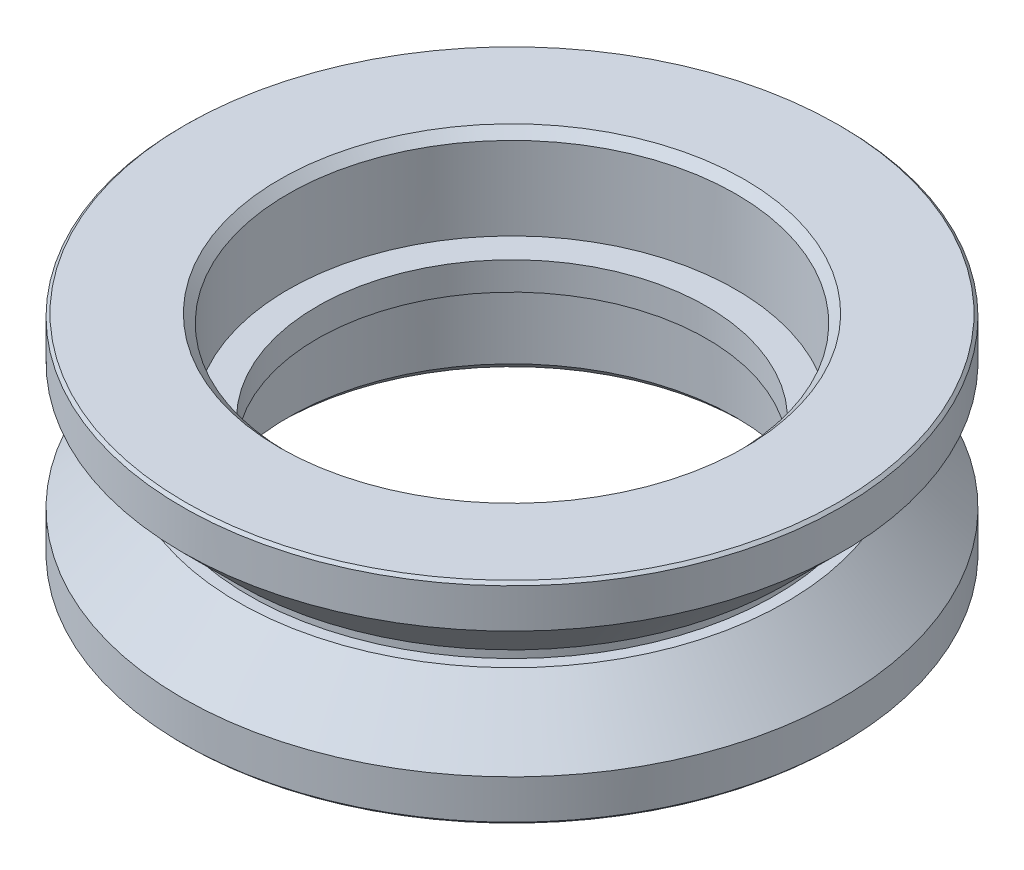
ISO-10303-21;
HEADER;
FILE_DESCRIPTION(('STEP AP214'),'2;1');
FILE_NAME('part.step','',(''),(''),'','','');
FILE_SCHEMA(('AUTOMOTIVE_DESIGN { 1 0 10303 214 1 1 1 1 }'));
ENDSEC;
DATA;
#1=APPLICATION_CONTEXT('core data for automotive mechanical design processes');
#2=APPLICATION_PROTOCOL_DEFINITION('international standard','automotive_design',2000,#1);
#3=PRODUCT_CONTEXT('',#1,'mechanical');
#4=PRODUCT('Part','Part','',(#3));
#5=PRODUCT_RELATED_PRODUCT_CATEGORY('part','',(#4));
#6=PRODUCT_DEFINITION_FORMATION('','',#4);
#7=PRODUCT_DEFINITION_CONTEXT('part definition',#1,'design');
#8=PRODUCT_DEFINITION('design','',#6,#7);
#9=PRODUCT_DEFINITION_SHAPE('','',#8);
#10=(LENGTH_UNIT() NAMED_UNIT(*) SI_UNIT(.MILLI.,.METRE.));
#11=(NAMED_UNIT(*) PLANE_ANGLE_UNIT() SI_UNIT($,.RADIAN.));
#12=(NAMED_UNIT(*) SI_UNIT($,.STERADIAN.) SOLID_ANGLE_UNIT());
#13=UNCERTAINTY_MEASURE_WITH_UNIT(LENGTH_MEASURE(1.E-05),#10,'distance_accuracy_value','');
#14=(GEOMETRIC_REPRESENTATION_CONTEXT(3) GLOBAL_UNCERTAINTY_ASSIGNED_CONTEXT((#13)) GLOBAL_UNIT_ASSIGNED_CONTEXT((#10,
#11,#12)) REPRESENTATION_CONTEXT('',''));
#15=CARTESIAN_POINT('',(0.,0.,0.));
#16=DIRECTION('',(0.,0.,1.));
#17=DIRECTION('',(1.,0.,0.));
#18=AXIS2_PLACEMENT_3D('',#15,#16,#17);
#19=CARTESIAN_POINT('',(0.,-3.65000000000213,0.));
#20=DIRECTION('',(0.,1.,0.));
#21=DIRECTION('',(-1.,0.,0.));
#22=AXIS2_PLACEMENT_3D('',#19,#20,#21);
#23=CONICAL_SURFACE('',#22,11.7500000000021,0.785398163400003);
#24=CARTESIAN_POINT('',(0.,-3.75000000000187,0.));
#25=DIRECTION('',(0.,1.,0.));
#26=DIRECTION('',(-1.,0.,0.));
#27=AXIS2_PLACEMENT_3D('',#24,#25,#26);
#28=CIRCLE('',#27,11.6500000000019);
#29=CARTESIAN_POINT('',(-11.6500000000019,-3.75000000000187,0.));
#30=VERTEX_POINT('',#29);
#31=EDGE_CURVE('E17',#30,#30,#28,.T.);
#32=ORIENTED_EDGE('',*,*,#31,.T.);
#33=EDGE_LOOP('',(#32));
#34=FACE_BOUND('',#33,.T.);
#35=CARTESIAN_POINT('',(0.,-3.65,0.));
#36=DIRECTION('',(0.,-1.,0.));
#37=DIRECTION('',(0.,0.,-1.));
#38=AXIS2_PLACEMENT_3D('',#35,#36,#37);
#39=CIRCLE('',#38,11.75);
#40=CARTESIAN_POINT('',(0.,-3.65,-11.75));
#41=VERTEX_POINT('',#40);
#42=EDGE_CURVE('E68',#41,#41,#39,.F.);
#43=ORIENTED_EDGE('',*,*,#42,.F.);
#44=EDGE_LOOP('',(#43));
#45=FACE_BOUND('',#44,.T.);
#46=ADVANCED_FACE('F14',(#34,#45),#23,.T.);
#47=CARTESIAN_POINT('',(0.,4.125,0.));
#48=DIRECTION('',(0.,-1.,0.));
#49=DIRECTION('',(0.,0.,-1.));
#50=AXIS2_PLACEMENT_3D('',#47,#48,#49);
#51=CYLINDRICAL_SURFACE('',#50,11.75);
#52=CARTESIAN_POINT('',(0.,-2.24999999999748,0.));
#53=DIRECTION('',(0.,-1.,0.));
#54=DIRECTION('',(0.,0.,1.));
#55=AXIS2_PLACEMENT_3D('',#52,#53,#54);
#56=CIRCLE('',#55,11.7500000000025);
#57=CARTESIAN_POINT('',(0.,-2.24999999999748,11.7500000000025));
#58=VERTEX_POINT('',#57);
#59=EDGE_CURVE('E60',#58,#58,#56,.F.);
#60=ORIENTED_EDGE('',*,*,#59,.F.);
#61=EDGE_LOOP('',(#60));
#62=FACE_BOUND('',#61,.T.);
#63=ORIENTED_EDGE('',*,*,#42,.T.);
#64=EDGE_LOOP('',(#63));
#65=FACE_BOUND('',#64,.T.);
#66=ADVANCED_FACE('F77',(#62,#65),#51,.T.);
#67=CARTESIAN_POINT('',(0.,-3.75,0.));
#68=DIRECTION('',(0.,1.,0.));
#69=DIRECTION('',(0.,0.,1.));
#70=AXIS2_PLACEMENT_3D('',#67,#68,#69);
#71=PLANE('',#70);
#72=CARTESIAN_POINT('',(0.,-3.74999999999962,0.));
#73=DIRECTION('',(0.,-1.,0.));
#74=DIRECTION('',(0.,0.,-1.));
#75=AXIS2_PLACEMENT_3D('',#72,#73,#74);
#76=CIRCLE('',#75,8.28715000000038);
#77=CARTESIAN_POINT('',(0.,-3.74999999999962,-8.28715000000038));
#78=VERTEX_POINT('',#77);
#79=EDGE_CURVE('E58',#78,#78,#76,.F.);
#80=ORIENTED_EDGE('',*,*,#79,.T.);
#81=EDGE_LOOP('',(#80));
#82=FACE_BOUND('',#81,.T.);
#83=ORIENTED_EDGE('',*,*,#31,.F.);
#84=EDGE_LOOP('',(#83));
#85=FACE_BOUND('',#84,.T.);
#86=ADVANCED_FACE('F85',(#82,#85),#71,.F.);
#87=CARTESIAN_POINT('',(0.,-2.24999999999748,0.));
#88=DIRECTION('',(0.,-1.,0.));
#89=DIRECTION('',(0.,0.,-1.));
#90=AXIS2_PLACEMENT_3D('',#87,#88,#89);
#91=CONICAL_SURFACE('',#90,11.7500000000025,0.7853981634);
#92=ORIENTED_EDGE('',*,*,#59,.T.);
#93=EDGE_LOOP('',(#92));
#94=FACE_BOUND('',#93,.T.);
#95=CARTESIAN_POINT('',(0.,-0.27500000000252,0.));
#96=DIRECTION('',(0.,-1.,0.));
#97=DIRECTION('',(0.,0.,-1.));
#98=AXIS2_PLACEMENT_3D('',#95,#96,#97);
#99=CIRCLE('',#98,9.77499999999748);
#100=CARTESIAN_POINT('',(0.,-0.27500000000252,-9.77499999999748));
#101=VERTEX_POINT('',#100);
#102=EDGE_CURVE('E56',#101,#101,#99,.T.);
#103=ORIENTED_EDGE('',*,*,#102,.T.);
#104=EDGE_LOOP('',(#103));
#105=FACE_BOUND('',#104,.T.);
#106=ADVANCED_FACE('F145',(#94,#105),#91,.T.);
#107=CARTESIAN_POINT('',(0.,-3.74999999999962,0.));
#108=DIRECTION('',(0.,-1.,0.));
#109=DIRECTION('',(0.,0.,-1.));
#110=AXIS2_PLACEMENT_3D('',#107,#108,#109);
#111=CONICAL_SURFACE('',#110,8.28715000000038,0.7853981634);
#112=CARTESIAN_POINT('',(0.,-3.449999999925,0.));
#113=DIRECTION('',(0.,1.,0.));
#114=DIRECTION('',(0.,0.,1.));
#115=AXIS2_PLACEMENT_3D('',#112,#113,#114);
#116=CIRCLE('',#115,7.98715);
#117=CARTESIAN_POINT('',(0.,-3.449999999925,7.98715));
#118=VERTEX_POINT('',#117);
#119=EDGE_CURVE('E55',#118,#118,#116,.T.);
#120=ORIENTED_EDGE('',*,*,#119,.T.);
#121=EDGE_LOOP('',(#120));
#122=FACE_BOUND('',#121,.T.);
#123=ORIENTED_EDGE('',*,*,#79,.F.);
#124=EDGE_LOOP('',(#123));
#125=FACE_BOUND('',#124,.T.);
#126=ADVANCED_FACE('F141',(#122,#125),#111,.F.);
#127=CARTESIAN_POINT('',(0.,-0.275,0.));
#128=DIRECTION('',(0.,-1.,0.));
#129=DIRECTION('',(0.,0.,-1.));
#130=AXIS2_PLACEMENT_3D('',#127,#128,#129);
#131=PLANE('',#130);
#132=CARTESIAN_POINT('',(0.,-0.275,0.));
#133=DIRECTION('',(0.,-1.,0.));
#134=DIRECTION('',(0.,0.,-1.));
#135=AXIS2_PLACEMENT_3D('',#132,#133,#134);
#136=CIRCLE('',#135,9.375);
#137=CARTESIAN_POINT('',(0.,-0.275,-9.375));
#138=VERTEX_POINT('',#137);
#139=EDGE_CURVE('E52',#138,#138,#136,.F.);
#140=ORIENTED_EDGE('',*,*,#139,.F.);
#141=EDGE_LOOP('',(#140));
#142=FACE_BOUND('',#141,.T.);
#143=ORIENTED_EDGE('',*,*,#102,.F.);
#144=EDGE_LOOP('',(#143));
#145=FACE_BOUND('',#144,.T.);
#146=ADVANCED_FACE('F137',(#142,#145),#131,.F.);
#147=CARTESIAN_POINT('',(0.,-3.75,0.));
#148=DIRECTION('',(0.,1.,0.));
#149=DIRECTION('',(0.,0.,1.));
#150=AXIS2_PLACEMENT_3D('',#147,#148,#149);
#151=CYLINDRICAL_SURFACE('',#150,7.98715);
#152=ORIENTED_EDGE('',*,*,#119,.F.);
#153=EDGE_LOOP('',(#152));
#154=FACE_BOUND('',#153,.T.);
#155=CARTESIAN_POINT('',(0.,-0.5,0.));
#156=DIRECTION('',(0.,1.,0.));
#157=DIRECTION('',(0.,0.,1.));
#158=AXIS2_PLACEMENT_3D('',#155,#156,#157);
#159=CIRCLE('',#158,7.98715);
#160=CARTESIAN_POINT('',(0.,-0.5,7.98715));
#161=VERTEX_POINT('',#160);
#162=EDGE_CURVE('E49',#161,#161,#159,.T.);
#163=ORIENTED_EDGE('',*,*,#162,.T.);
#164=EDGE_LOOP('',(#163));
#165=FACE_BOUND('',#164,.T.);
#166=ADVANCED_FACE('F133',(#154,#165),#151,.F.);
#167=CARTESIAN_POINT('',(0.,0.3025,0.));
#168=DIRECTION('',(0.,-1.,0.));
#169=DIRECTION('',(0.,0.,-1.));
#170=AXIS2_PLACEMENT_3D('',#167,#168,#169);
#171=CYLINDRICAL_SURFACE('',#170,9.375);
#172=ORIENTED_EDGE('',*,*,#139,.T.);
#173=EDGE_LOOP('',(#172));
#174=FACE_BOUND('',#173,.T.);
#175=CARTESIAN_POINT('',(0.,0.275,0.));
#176=DIRECTION('',(0.,-1.,0.));
#177=DIRECTION('',(0.,0.,-1.));
#178=AXIS2_PLACEMENT_3D('',#175,#176,#177);
#179=CIRCLE('',#178,9.375);
#180=CARTESIAN_POINT('',(0.,0.275,-9.375));
#181=VERTEX_POINT('',#180);
#182=EDGE_CURVE('E46',#181,#181,#179,.F.);
#183=ORIENTED_EDGE('',*,*,#182,.F.);
#184=EDGE_LOOP('',(#183));
#185=FACE_BOUND('',#184,.T.);
#186=ADVANCED_FACE('F129',(#174,#185),#171,.T.);
#187=CARTESIAN_POINT('',(0.,-0.5,0.));
#188=DIRECTION('',(0.,1.,0.));
#189=DIRECTION('',(0.,0.,1.));
#190=AXIS2_PLACEMENT_3D('',#187,#188,#189);
#191=PLANE('',#190);
#192=CARTESIAN_POINT('',(0.,-0.5,0.));
#193=DIRECTION('',(0.,1.,0.));
#194=DIRECTION('',(0.,0.,1.));
#195=AXIS2_PLACEMENT_3D('',#192,#193,#194);
#196=CIRCLE('',#195,6.947169826516);
#197=CARTESIAN_POINT('',(0.,-0.5,6.947169826516));
#198=VERTEX_POINT('',#197);
#199=EDGE_CURVE('E43',#198,#198,#196,.T.);
#200=ORIENTED_EDGE('',*,*,#199,.T.);
#201=EDGE_LOOP('',(#200));
#202=FACE_BOUND('',#201,.T.);
#203=ORIENTED_EDGE('',*,*,#162,.F.);
#204=EDGE_LOOP('',(#203));
#205=FACE_BOUND('',#204,.T.);
#206=ADVANCED_FACE('F125',(#202,#205),#191,.F.);
#207=CARTESIAN_POINT('',(0.,0.275,0.));
#208=DIRECTION('',(0.,-1.,0.));
#209=DIRECTION('',(0.,0.,-1.));
#210=AXIS2_PLACEMENT_3D('',#207,#208,#209);
#211=PLANE('',#210);
#212=ORIENTED_EDGE('',*,*,#182,.T.);
#213=EDGE_LOOP('',(#212));
#214=FACE_BOUND('',#213,.T.);
#215=CARTESIAN_POINT('',(0.,0.27500000000252,0.));
#216=DIRECTION('',(0.,1.,0.));
#217=DIRECTION('',(0.,0.,1.));
#218=AXIS2_PLACEMENT_3D('',#215,#216,#217);
#219=CIRCLE('',#218,9.77499999999748);
#220=CARTESIAN_POINT('',(0.,0.27500000000252,9.77499999999748));
#221=VERTEX_POINT('',#220);
#222=EDGE_CURVE('E40',#221,#221,#219,.T.);
#223=ORIENTED_EDGE('',*,*,#222,.F.);
#224=EDGE_LOOP('',(#223));
#225=FACE_BOUND('',#224,.T.);
#226=ADVANCED_FACE('F121',(#214,#225),#211,.T.);
#227=CARTESIAN_POINT('',(0.,-0.5,0.));
#228=DIRECTION('',(0.,1.,0.));
#229=DIRECTION('',(0.,0.,1.));
#230=AXIS2_PLACEMENT_3D('',#227,#228,#229);
#231=CYLINDRICAL_SURFACE('',#230,6.947169826516);
#232=CARTESIAN_POINT('',(0.,0.5,0.));
#233=DIRECTION('',(0.,1.,0.));
#234=DIRECTION('',(0.,0.,1.));
#235=AXIS2_PLACEMENT_3D('',#232,#233,#234);
#236=CIRCLE('',#235,6.947169826516);
#237=CARTESIAN_POINT('',(0.,0.5,6.947169826516));
#238=VERTEX_POINT('',#237);
#239=EDGE_CURVE('E37',#238,#238,#236,.F.);
#240=ORIENTED_EDGE('',*,*,#239,.F.);
#241=EDGE_LOOP('',(#240));
#242=FACE_BOUND('',#241,.T.);
#243=ORIENTED_EDGE('',*,*,#199,.F.);
#244=EDGE_LOOP('',(#243));
#245=FACE_BOUND('',#244,.T.);
#246=ADVANCED_FACE('F117',(#242,#245),#231,.F.);
#247=CARTESIAN_POINT('',(0.,2.24999999999748,0.));
#248=DIRECTION('',(0.,1.,0.));
#249=DIRECTION('',(0.,0.,1.));
#250=AXIS2_PLACEMENT_3D('',#247,#248,#249);
#251=CONICAL_SURFACE('',#250,11.7500000000025,0.7853981634);
#252=CARTESIAN_POINT('',(0.,2.25,0.));
#253=DIRECTION('',(0.,-1.,0.));
#254=DIRECTION('',(0.,0.,-1.));
#255=AXIS2_PLACEMENT_3D('',#252,#253,#254);
#256=CIRCLE('',#255,11.75);
#257=CARTESIAN_POINT('',(0.,2.25,-11.75));
#258=VERTEX_POINT('',#257);
#259=EDGE_CURVE('E36',#258,#258,#256,.F.);
#260=ORIENTED_EDGE('',*,*,#259,.F.);
#261=EDGE_LOOP('',(#260));
#262=FACE_BOUND('',#261,.T.);
#263=ORIENTED_EDGE('',*,*,#222,.T.);
#264=EDGE_LOOP('',(#263));
#265=FACE_BOUND('',#264,.T.);
#266=ADVANCED_FACE('F113',(#262,#265),#251,.T.);
#267=CARTESIAN_POINT('',(0.,0.5,0.));
#268=DIRECTION('',(0.,1.,0.));
#269=DIRECTION('',(0.,0.,1.));
#270=AXIS2_PLACEMENT_3D('',#267,#268,#269);
#271=PLANE('',#270);
#272=ORIENTED_EDGE('',*,*,#239,.T.);
#273=EDGE_LOOP('',(#272));
#274=FACE_BOUND('',#273,.T.);
#275=CARTESIAN_POINT('',(0.,0.5,0.));
#276=DIRECTION('',(0.,1.,0.));
#277=DIRECTION('',(0.,0.,1.));
#278=AXIS2_PLACEMENT_3D('',#275,#276,#277);
#279=CIRCLE('',#278,7.98715);
#280=CARTESIAN_POINT('',(0.,0.5,7.98715));
#281=VERTEX_POINT('',#280);
#282=EDGE_CURVE('E32',#281,#281,#279,.T.);
#283=ORIENTED_EDGE('',*,*,#282,.T.);
#284=EDGE_LOOP('',(#283));
#285=FACE_BOUND('',#284,.T.);
#286=ADVANCED_FACE('F109',(#274,#285),#271,.T.);
#287=CARTESIAN_POINT('',(0.,4.125,0.));
#288=DIRECTION('',(0.,-1.,0.));
#289=DIRECTION('',(0.,0.,-1.));
#290=AXIS2_PLACEMENT_3D('',#287,#288,#289);
#291=CYLINDRICAL_SURFACE('',#290,11.75);
#292=ORIENTED_EDGE('',*,*,#259,.T.);
#293=EDGE_LOOP('',(#292));
#294=FACE_BOUND('',#293,.T.);
#295=CARTESIAN_POINT('',(0.,3.65000000000163,0.));
#296=DIRECTION('',(0.,-1.,0.));
#297=DIRECTION('',(0.,0.,-1.));
#298=AXIS2_PLACEMENT_3D('',#295,#296,#297);
#299=CIRCLE('',#298,11.7500000000016);
#300=CARTESIAN_POINT('',(0.,3.65000000000163,-11.7500000000016));
#301=VERTEX_POINT('',#300);
#302=EDGE_CURVE('E35',#301,#301,#299,.F.);
#303=ORIENTED_EDGE('',*,*,#302,.F.);
#304=EDGE_LOOP('',(#303));
#305=FACE_BOUND('',#304,.T.);
#306=ADVANCED_FACE('F105',(#294,#305),#291,.T.);
#307=CARTESIAN_POINT('',(0.,-3.75,0.));
#308=DIRECTION('',(0.,1.,0.));
#309=DIRECTION('',(0.,0.,1.));
#310=AXIS2_PLACEMENT_3D('',#307,#308,#309);
#311=CYLINDRICAL_SURFACE('',#310,7.98715);
#312=CARTESIAN_POINT('',(0.,3.45000000000038,0.));
#313=DIRECTION('',(0.,1.,0.));
#314=DIRECTION('',(0.,0.,-1.));
#315=AXIS2_PLACEMENT_3D('',#312,#313,#314);
#316=CIRCLE('',#315,7.98714999999962);
#317=CARTESIAN_POINT('',(0.,3.45000000000038,-7.98714999999962));
#318=VERTEX_POINT('',#317);
#319=EDGE_CURVE('E26',#318,#318,#316,.T.);
#320=ORIENTED_EDGE('',*,*,#319,.T.);
#321=EDGE_LOOP('',(#320));
#322=FACE_BOUND('',#321,.T.);
#323=ORIENTED_EDGE('',*,*,#282,.F.);
#324=EDGE_LOOP('',(#323));
#325=FACE_BOUND('',#324,.T.);
#326=ADVANCED_FACE('F101',(#322,#325),#311,.F.);
#327=CARTESIAN_POINT('',(0.,3.65000000000163,0.));
#328=DIRECTION('',(0.,-1.,0.));
#329=DIRECTION('',(1.,0.,0.));
#330=AXIS2_PLACEMENT_3D('',#327,#328,#329);
#331=CONICAL_SURFACE('',#330,11.7500000000016,0.785398163399998);
#332=ORIENTED_EDGE('',*,*,#302,.T.);
#333=EDGE_LOOP('',(#332));
#334=FACE_BOUND('',#333,.T.);
#335=CARTESIAN_POINT('',(0.,3.75000000000137,0.));
#336=DIRECTION('',(0.,-1.,0.));
#337=DIRECTION('',(1.,0.,0.));
#338=AXIS2_PLACEMENT_3D('',#335,#336,#337);
#339=CIRCLE('',#338,11.6500000000014);
#340=CARTESIAN_POINT('',(11.6500000000014,3.75000000000137,0.));
#341=VERTEX_POINT('',#340);
#342=EDGE_CURVE('E21',#341,#341,#339,.F.);
#343=ORIENTED_EDGE('',*,*,#342,.F.);
#344=EDGE_LOOP('',(#343));
#345=FACE_BOUND('',#344,.T.);
#346=ADVANCED_FACE('F94',(#334,#345),#331,.T.);
#347=CARTESIAN_POINT('',(0.,3.74999999999962,0.));
#348=DIRECTION('',(0.,1.,0.));
#349=DIRECTION('',(0.,0.,1.));
#350=AXIS2_PLACEMENT_3D('',#347,#348,#349);
#351=CONICAL_SURFACE('',#350,8.28715000000038,0.785398163400001);
#352=ORIENTED_EDGE('',*,*,#319,.F.);
#353=EDGE_LOOP('',(#352));
#354=FACE_BOUND('',#353,.T.);
#355=CARTESIAN_POINT('',(0.,3.74999999999962,0.));
#356=DIRECTION('',(0.,1.,0.));
#357=DIRECTION('',(0.,0.,1.));
#358=AXIS2_PLACEMENT_3D('',#355,#356,#357);
#359=CIRCLE('',#358,8.28715000000038);
#360=CARTESIAN_POINT('',(0.,3.74999999999962,8.28715000000038));
#361=VERTEX_POINT('',#360);
#362=EDGE_CURVE('E10',#361,#361,#359,.F.);
#363=ORIENTED_EDGE('',*,*,#362,.F.);
#364=EDGE_LOOP('',(#363));
#365=FACE_BOUND('',#364,.T.);
#366=ADVANCED_FACE('F89',(#354,#365),#351,.F.);
#367=CARTESIAN_POINT('',(0.,3.75,0.));
#368=DIRECTION('',(0.,1.,0.));
#369=DIRECTION('',(0.,0.,1.));
#370=AXIS2_PLACEMENT_3D('',#367,#368,#369);
#371=PLANE('',#370);
#372=ORIENTED_EDGE('',*,*,#362,.T.);
#373=EDGE_LOOP('',(#372));
#374=FACE_BOUND('',#373,.T.);
#375=ORIENTED_EDGE('',*,*,#342,.T.);
#376=EDGE_LOOP('',(#375));
#377=FACE_BOUND('',#376,.T.);
#378=ADVANCED_FACE('F87',(#374,#377),#371,.T.);
#379=CLOSED_SHELL('',(#46,#66,#86,#106,#126,#146,#166,#186,#206,#226,#246,#266,#286,#306,#326,
#346,#366,#378));
#380=MANIFOLD_SOLID_BREP('B1',#379);
#381=ADVANCED_BREP_SHAPE_REPRESENTATION('',(#18,#380),#14);
#382=SHAPE_DEFINITION_REPRESENTATION(#9,#381);
ENDSEC;
END-ISO-10303-21;
